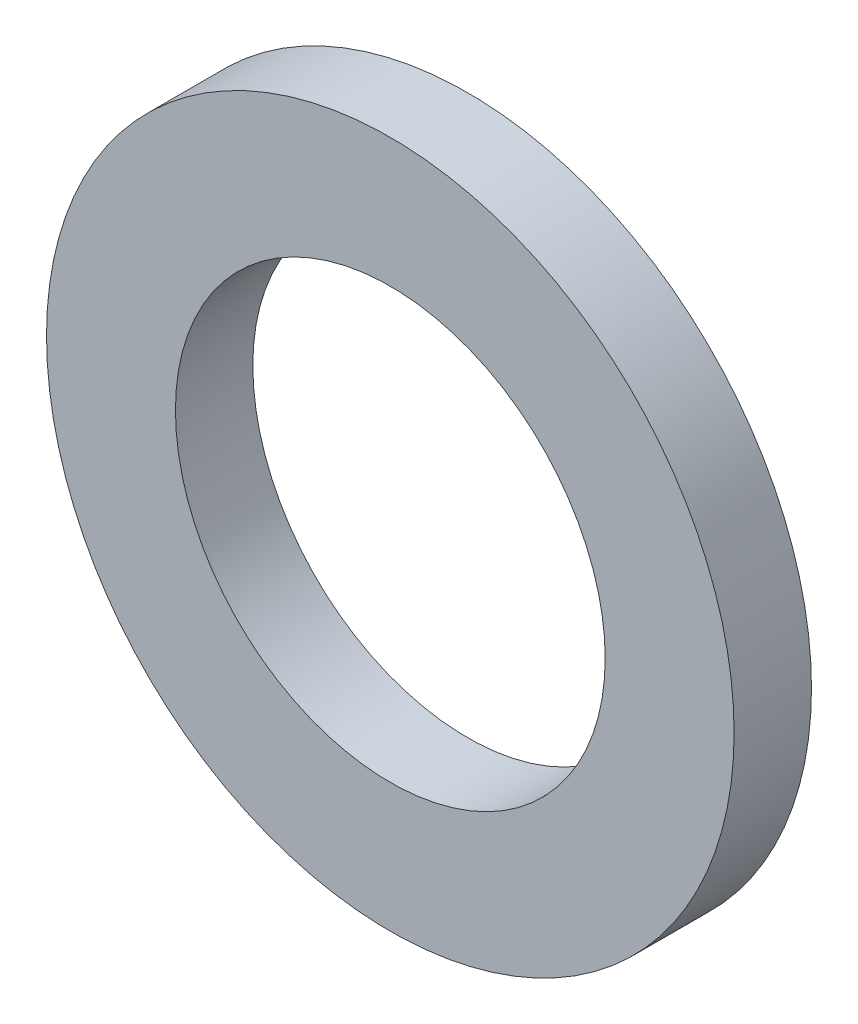
ISO-10303-21;
HEADER;
FILE_DESCRIPTION(('STEP AP214'),'2;1');
FILE_NAME('part.step','',(''),(''),'','','');
FILE_SCHEMA(('AUTOMOTIVE_DESIGN { 1 0 10303 214 1 1 1 1 }'));
ENDSEC;
DATA;
#1=APPLICATION_CONTEXT('core data for automotive mechanical design processes');
#2=APPLICATION_PROTOCOL_DEFINITION('international standard','automotive_design',2000,#1);
#3=PRODUCT_CONTEXT('',#1,'mechanical');
#4=PRODUCT('Part','Part','',(#3));
#5=PRODUCT_RELATED_PRODUCT_CATEGORY('part','',(#4));
#6=PRODUCT_DEFINITION_FORMATION('','',#4);
#7=PRODUCT_DEFINITION_CONTEXT('part definition',#1,'design');
#8=PRODUCT_DEFINITION('design','',#6,#7);
#9=PRODUCT_DEFINITION_SHAPE('','',#8);
#10=(LENGTH_UNIT() NAMED_UNIT(*) SI_UNIT(.MILLI.,.METRE.));
#11=(NAMED_UNIT(*) PLANE_ANGLE_UNIT() SI_UNIT($,.RADIAN.));
#12=(NAMED_UNIT(*) SI_UNIT($,.STERADIAN.) SOLID_ANGLE_UNIT());
#13=UNCERTAINTY_MEASURE_WITH_UNIT(LENGTH_MEASURE(1.E-05),#10,'distance_accuracy_value','');
#14=(GEOMETRIC_REPRESENTATION_CONTEXT(3) GLOBAL_UNCERTAINTY_ASSIGNED_CONTEXT((#13)) GLOBAL_UNIT_ASSIGNED_CONTEXT((#10,
#11,#12)) REPRESENTATION_CONTEXT('',''));
#15=CARTESIAN_POINT('',(0.,0.,0.));
#16=DIRECTION('',(0.,0.,1.));
#17=DIRECTION('',(1.,0.,0.));
#18=AXIS2_PLACEMENT_3D('',#15,#16,#17);
#19=CARTESIAN_POINT('',(0.,0.,2.7));
#20=DIRECTION('',(0.,0.,1.));
#21=DIRECTION('',(1.,0.,0.));
#22=AXIS2_PLACEMENT_3D('',#19,#20,#21);
#23=PLANE('',#22);
#24=CARTESIAN_POINT('',(0.,0.,2.7));
#25=DIRECTION('',(0.,0.,1.));
#26=DIRECTION('',(1.,0.,0.));
#27=AXIS2_PLACEMENT_3D('',#24,#25,#26);
#28=CIRCLE('',#27,12.);
#29=CARTESIAN_POINT('',(12.,0.,2.7));
#30=VERTEX_POINT('',#29);
#31=EDGE_CURVE('E10',#30,#30,#28,.T.);
#32=ORIENTED_EDGE('',*,*,#31,.T.);
#33=EDGE_LOOP('',(#32));
#34=FACE_BOUND('',#33,.T.);
#35=CARTESIAN_POINT('',(0.,0.,2.7));
#36=DIRECTION('',(0.,0.,1.));
#37=DIRECTION('',(1.,0.,0.));
#38=AXIS2_PLACEMENT_3D('',#35,#36,#37);
#39=CIRCLE('',#38,7.5);
#40=CARTESIAN_POINT('',(7.5,0.,2.7));
#41=VERTEX_POINT('',#40);
#42=EDGE_CURVE('E41',#41,#41,#39,.T.);
#43=ORIENTED_EDGE('',*,*,#42,.F.);
#44=EDGE_LOOP('',(#43));
#45=FACE_BOUND('',#44,.T.);
#46=ADVANCED_FACE('F30',(#34,#45),#23,.T.);
#47=CARTESIAN_POINT('',(0.,0.,0.));
#48=DIRECTION('',(0.,0.,1.));
#49=DIRECTION('',(1.,0.,0.));
#50=AXIS2_PLACEMENT_3D('',#47,#48,#49);
#51=PLANE('',#50);
#52=CARTESIAN_POINT('',(0.,0.,0.));
#53=DIRECTION('',(0.,0.,1.));
#54=DIRECTION('',(1.,0.,0.));
#55=AXIS2_PLACEMENT_3D('',#52,#53,#54);
#56=CIRCLE('',#55,12.);
#57=CARTESIAN_POINT('',(12.,0.,0.));
#58=VERTEX_POINT('',#57);
#59=EDGE_CURVE('E34',#58,#58,#56,.T.);
#60=ORIENTED_EDGE('',*,*,#59,.F.);
#61=EDGE_LOOP('',(#60));
#62=FACE_BOUND('',#61,.T.);
#63=CARTESIAN_POINT('',(0.,0.,0.));
#64=DIRECTION('',(0.,0.,1.));
#65=DIRECTION('',(1.,0.,0.));
#66=AXIS2_PLACEMENT_3D('',#63,#64,#65);
#67=CIRCLE('',#66,7.5);
#68=CARTESIAN_POINT('',(7.5,0.,0.));
#69=VERTEX_POINT('',#68);
#70=EDGE_CURVE('E43',#69,#69,#67,.T.);
#71=ORIENTED_EDGE('',*,*,#70,.T.);
#72=EDGE_LOOP('',(#71));
#73=FACE_BOUND('',#72,.T.);
#74=ADVANCED_FACE('F53',(#62,#73),#51,.F.);
#75=CARTESIAN_POINT('',(0.,0.,2.7));
#76=DIRECTION('',(0.,0.,-1.));
#77=DIRECTION('',(-1.,0.,0.));
#78=AXIS2_PLACEMENT_3D('',#75,#76,#77);
#79=CYLINDRICAL_SURFACE('',#78,12.);
#80=ORIENTED_EDGE('',*,*,#31,.F.);
#81=EDGE_LOOP('',(#80));
#82=FACE_BOUND('',#81,.T.);
#83=ORIENTED_EDGE('',*,*,#59,.T.);
#84=EDGE_LOOP('',(#83));
#85=FACE_BOUND('',#84,.T.);
#86=ADVANCED_FACE('F32',(#82,#85),#79,.T.);
#87=CARTESIAN_POINT('',(0.,0.,2.7));
#88=DIRECTION('',(0.,0.,-1.));
#89=DIRECTION('',(-1.,0.,0.));
#90=AXIS2_PLACEMENT_3D('',#87,#88,#89);
#91=CYLINDRICAL_SURFACE('',#90,7.5);
#92=ORIENTED_EDGE('',*,*,#42,.T.);
#93=EDGE_LOOP('',(#92));
#94=FACE_BOUND('',#93,.T.);
#95=ORIENTED_EDGE('',*,*,#70,.F.);
#96=EDGE_LOOP('',(#95));
#97=FACE_BOUND('',#96,.T.);
#98=ADVANCED_FACE('F49',(#94,#97),#91,.F.);
#99=CLOSED_SHELL('',(#46,#74,#86,#98));
#100=MANIFOLD_SOLID_BREP('B2',#99);
#101=ADVANCED_BREP_SHAPE_REPRESENTATION('',(#18,#100),#14);
#102=SHAPE_DEFINITION_REPRESENTATION(#9,#101);
ENDSEC;
END-ISO-10303-21;
